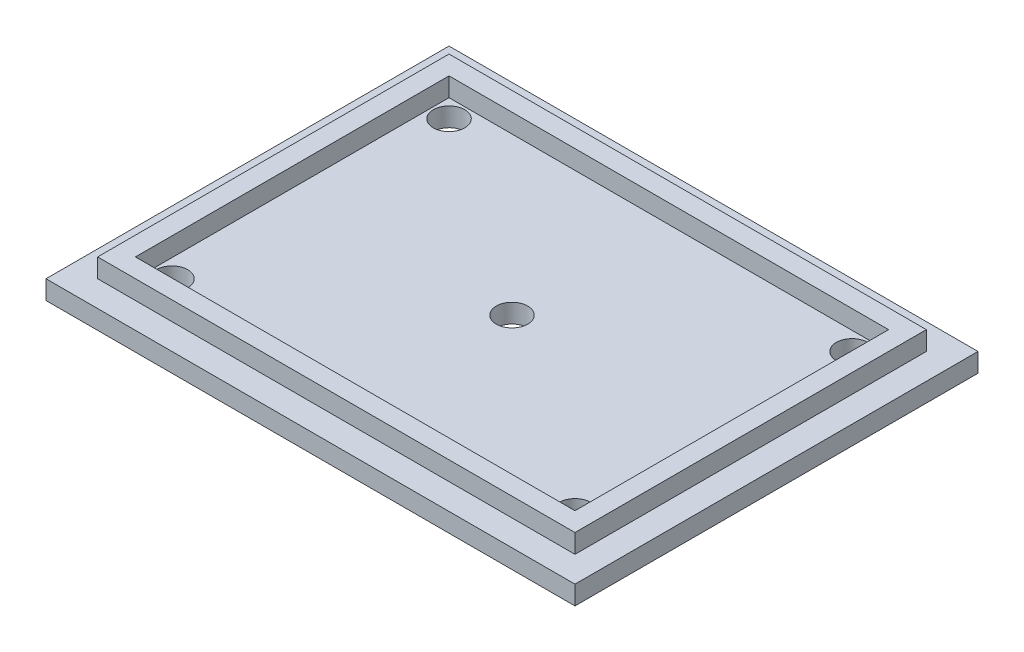
ISO-10303-21;
HEADER;
FILE_DESCRIPTION(('STEP AP214'),'2;1');
FILE_NAME('part.step','',(''),(''),'','','');
FILE_SCHEMA(('AUTOMOTIVE_DESIGN { 1 0 10303 214 1 1 1 1 }'));
ENDSEC;
DATA;
#1=APPLICATION_CONTEXT('core data for automotive mechanical design processes');
#2=APPLICATION_PROTOCOL_DEFINITION('international standard','automotive_design',2000,#1);
#3=PRODUCT_CONTEXT('',#1,'mechanical');
#4=PRODUCT('Part','Part','',(#3));
#5=PRODUCT_RELATED_PRODUCT_CATEGORY('part','',(#4));
#6=PRODUCT_DEFINITION_FORMATION('','',#4);
#7=PRODUCT_DEFINITION_CONTEXT('part definition',#1,'design');
#8=PRODUCT_DEFINITION('design','',#6,#7);
#9=PRODUCT_DEFINITION_SHAPE('','',#8);
#10=(LENGTH_UNIT() NAMED_UNIT(*) SI_UNIT(.MILLI.,.METRE.));
#11=(NAMED_UNIT(*) PLANE_ANGLE_UNIT() SI_UNIT($,.RADIAN.));
#12=(NAMED_UNIT(*) SI_UNIT($,.STERADIAN.) SOLID_ANGLE_UNIT());
#13=UNCERTAINTY_MEASURE_WITH_UNIT(LENGTH_MEASURE(1.E-05),#10,'distance_accuracy_value','');
#14=(GEOMETRIC_REPRESENTATION_CONTEXT(3) GLOBAL_UNCERTAINTY_ASSIGNED_CONTEXT((#13)) GLOBAL_UNIT_ASSIGNED_CONTEXT((#10,
#11,#12)) REPRESENTATION_CONTEXT('',''));
#15=CARTESIAN_POINT('',(0.,0.,0.));
#16=DIRECTION('',(0.,0.,1.));
#17=DIRECTION('',(1.,0.,0.));
#18=AXIS2_PLACEMENT_3D('',#15,#16,#17);
#19=CARTESIAN_POINT('',(0.,3.,0.));
#20=DIRECTION('',(0.,-1.,0.));
#21=DIRECTION('',(0.,0.,-1.));
#22=AXIS2_PLACEMENT_3D('',#19,#20,#21);
#23=PLANE('',#22);
#24=DIRECTION('',(0.,0.,1.));
#25=VECTOR('',#24,1.);
#26=CARTESIAN_POINT('',(0.,3.,0.));
#27=LINE('',#26,#25);
#28=CARTESIAN_POINT('',(0.,3.,-64.));
#29=VERTEX_POINT('',#28);
#30=CARTESIAN_POINT('',(0.,3.,0.));
#31=VERTEX_POINT('',#30);
#32=EDGE_CURVE('E229',#29,#31,#27,.T.);
#33=ORIENTED_EDGE('',*,*,#32,.T.);
#34=DIRECTION('',(1.,0.,0.));
#35=VECTOR('',#34,1.);
#36=CARTESIAN_POINT('',(0.,3.,0.));
#37=LINE('',#36,#35);
#38=CARTESIAN_POINT('',(84.,3.,0.));
#39=VERTEX_POINT('',#38);
#40=EDGE_CURVE('E233',#31,#39,#37,.T.);
#41=ORIENTED_EDGE('',*,*,#40,.T.);
#42=DIRECTION('',(0.,0.,-1.));
#43=VECTOR('',#42,1.);
#44=CARTESIAN_POINT('',(84.,3.,0.));
#45=LINE('',#44,#43);
#46=CARTESIAN_POINT('',(84.,3.,-64.));
#47=VERTEX_POINT('',#46);
#48=EDGE_CURVE('E237',#39,#47,#45,.T.);
#49=ORIENTED_EDGE('',*,*,#48,.T.);
#50=DIRECTION('',(-1.,0.,0.));
#51=VECTOR('',#50,1.);
#52=CARTESIAN_POINT('',(0.,3.,-64.));
#53=LINE('',#52,#51);
#54=EDGE_CURVE('E240',#47,#29,#53,.T.);
#55=ORIENTED_EDGE('',*,*,#54,.T.);
#56=EDGE_LOOP('',(#33,#41,#49,#55));
#57=FACE_BOUND('',#56,.T.);
#58=DIRECTION('',(0.,0.,1.));
#59=VECTOR('',#58,1.);
#60=CARTESIAN_POINT('',(4.1,3.,-59.9));
#61=LINE('',#60,#59);
#62=CARTESIAN_POINT('',(4.1,3.,-59.9));
#63=VERTEX_POINT('',#62);
#64=CARTESIAN_POINT('',(4.10000000000001,3.,-4.1));
#65=VERTEX_POINT('',#64);
#66=EDGE_CURVE('E154',#63,#65,#61,.T.);
#67=ORIENTED_EDGE('',*,*,#66,.F.);
#68=DIRECTION('',(-1.,0.,0.));
#69=VECTOR('',#68,1.);
#70=CARTESIAN_POINT('',(4.1,3.,-59.9));
#71=LINE('',#70,#69);
#72=CARTESIAN_POINT('',(79.9,3.,-59.9));
#73=VERTEX_POINT('',#72);
#74=EDGE_CURVE('E194',#73,#63,#71,.T.);
#75=ORIENTED_EDGE('',*,*,#74,.F.);
#76=DIRECTION('',(0.,0.,-1.));
#77=VECTOR('',#76,1.);
#78=CARTESIAN_POINT('',(79.9,3.,-59.9));
#79=LINE('',#78,#77);
#80=CARTESIAN_POINT('',(79.9,3.,-4.1));
#81=VERTEX_POINT('',#80);
#82=EDGE_CURVE('E66',#81,#73,#79,.T.);
#83=ORIENTED_EDGE('',*,*,#82,.F.);
#84=DIRECTION('',(1.,0.,0.));
#85=VECTOR('',#84,1.);
#86=CARTESIAN_POINT('',(4.10000000000001,3.,-4.1));
#87=LINE('',#86,#85);
#88=EDGE_CURVE('E61',#65,#81,#87,.T.);
#89=ORIENTED_EDGE('',*,*,#88,.F.);
#90=EDGE_LOOP('',(#67,#75,#83,#89));
#91=FACE_BOUND('',#90,.T.);
#92=ADVANCED_FACE('F43',(#57,#91),#23,.F.);
#93=CARTESIAN_POINT('',(0.,3.,0.));
#94=DIRECTION('',(1.,0.,0.));
#95=DIRECTION('',(0.,0.,-1.));
#96=AXIS2_PLACEMENT_3D('',#93,#94,#95);
#97=PLANE('',#96);
#98=DIRECTION('',(0.,0.,1.));
#99=VECTOR('',#98,1.);
#100=CARTESIAN_POINT('',(0.,0.,0.));
#101=LINE('',#100,#99);
#102=CARTESIAN_POINT('',(0.,0.,-64.));
#103=VERTEX_POINT('',#102);
#104=CARTESIAN_POINT('',(0.,0.,0.));
#105=VERTEX_POINT('',#104);
#106=EDGE_CURVE('E228',#103,#105,#101,.T.);
#107=ORIENTED_EDGE('',*,*,#106,.T.);
#108=DIRECTION('',(0.,-1.,0.));
#109=VECTOR('',#108,1.);
#110=CARTESIAN_POINT('',(0.,3.,0.));
#111=LINE('',#110,#109);
#112=EDGE_CURVE('E11',#31,#105,#111,.T.);
#113=ORIENTED_EDGE('',*,*,#112,.F.);
#114=ORIENTED_EDGE('',*,*,#32,.F.);
#115=DIRECTION('',(0.,-1.,0.));
#116=VECTOR('',#115,1.);
#117=CARTESIAN_POINT('',(0.,3.,-64.));
#118=LINE('',#117,#116);
#119=EDGE_CURVE('E243',#29,#103,#118,.T.);
#120=ORIENTED_EDGE('',*,*,#119,.T.);
#121=EDGE_LOOP('',(#107,#113,#114,#120));
#122=FACE_BOUND('',#121,.T.);
#123=ADVANCED_FACE('F45',(#122),#97,.F.);
#124=CARTESIAN_POINT('',(0.,3.,0.));
#125=DIRECTION('',(0.,0.,-1.));
#126=DIRECTION('',(-1.,0.,0.));
#127=AXIS2_PLACEMENT_3D('',#124,#125,#126);
#128=PLANE('',#127);
#129=DIRECTION('',(1.,0.,0.));
#130=VECTOR('',#129,1.);
#131=CARTESIAN_POINT('',(0.,0.,0.));
#132=LINE('',#131,#130);
#133=CARTESIAN_POINT('',(84.,0.,0.));
#134=VERTEX_POINT('',#133);
#135=EDGE_CURVE('E247',#105,#134,#132,.T.);
#136=ORIENTED_EDGE('',*,*,#135,.T.);
#137=DIRECTION('',(0.,-1.,0.));
#138=VECTOR('',#137,1.);
#139=CARTESIAN_POINT('',(84.,3.,0.));
#140=LINE('',#139,#138);
#141=EDGE_CURVE('E53',#39,#134,#140,.T.);
#142=ORIENTED_EDGE('',*,*,#141,.F.);
#143=ORIENTED_EDGE('',*,*,#40,.F.);
#144=ORIENTED_EDGE('',*,*,#112,.T.);
#145=EDGE_LOOP('',(#136,#142,#143,#144));
#146=FACE_BOUND('',#145,.T.);
#147=ADVANCED_FACE('F307',(#146),#128,.F.);
#148=CARTESIAN_POINT('',(84.,3.,0.));
#149=DIRECTION('',(-1.,0.,0.));
#150=DIRECTION('',(0.,0.,1.));
#151=AXIS2_PLACEMENT_3D('',#148,#149,#150);
#152=PLANE('',#151);
#153=DIRECTION('',(0.,0.,-1.));
#154=VECTOR('',#153,1.);
#155=CARTESIAN_POINT('',(84.,0.,0.));
#156=LINE('',#155,#154);
#157=CARTESIAN_POINT('',(84.,0.,-64.));
#158=VERTEX_POINT('',#157);
#159=EDGE_CURVE('E250',#134,#158,#156,.T.);
#160=ORIENTED_EDGE('',*,*,#159,.T.);
#161=DIRECTION('',(0.,-1.,0.));
#162=VECTOR('',#161,1.);
#163=CARTESIAN_POINT('',(84.,3.,-64.));
#164=LINE('',#163,#162);
#165=EDGE_CURVE('E258',#47,#158,#164,.T.);
#166=ORIENTED_EDGE('',*,*,#165,.F.);
#167=ORIENTED_EDGE('',*,*,#48,.F.);
#168=ORIENTED_EDGE('',*,*,#141,.T.);
#169=EDGE_LOOP('',(#160,#166,#167,#168));
#170=FACE_BOUND('',#169,.T.);
#171=ADVANCED_FACE('F499',(#170),#152,.F.);
#172=CARTESIAN_POINT('',(0.,3.,-64.));
#173=DIRECTION('',(0.,0.,1.));
#174=DIRECTION('',(1.,0.,0.));
#175=AXIS2_PLACEMENT_3D('',#172,#173,#174);
#176=PLANE('',#175);
#177=DIRECTION('',(-1.,0.,0.));
#178=VECTOR('',#177,1.);
#179=CARTESIAN_POINT('',(0.,0.,-64.));
#180=LINE('',#179,#178);
#181=EDGE_CURVE('E234',#158,#103,#180,.T.);
#182=ORIENTED_EDGE('',*,*,#181,.T.);
#183=ORIENTED_EDGE('',*,*,#119,.F.);
#184=ORIENTED_EDGE('',*,*,#54,.F.);
#185=ORIENTED_EDGE('',*,*,#165,.T.);
#186=EDGE_LOOP('',(#182,#183,#184,#185));
#187=FACE_BOUND('',#186,.T.);
#188=ADVANCED_FACE('F402',(#187),#176,.F.);
#189=CARTESIAN_POINT('',(0.,0.,0.));
#190=DIRECTION('',(0.,-1.,0.));
#191=DIRECTION('',(0.,0.,-1.));
#192=AXIS2_PLACEMENT_3D('',#189,#190,#191);
#193=PLANE('',#192);
#194=CARTESIAN_POINT('',(10.,0.,-54.));
#195=DIRECTION('',(0.,-1.,0.));
#196=DIRECTION('',(0.,0.,-1.));
#197=AXIS2_PLACEMENT_3D('',#194,#195,#196);
#198=CIRCLE('',#197,2.5);
#199=CARTESIAN_POINT('',(10.,0.,-56.5));
#200=VERTEX_POINT('',#199);
#201=EDGE_CURVE('E572',#200,#200,#198,.T.);
#202=ORIENTED_EDGE('',*,*,#201,.F.);
#203=EDGE_LOOP('',(#202));
#204=FACE_BOUND('',#203,.T.);
#205=CARTESIAN_POINT('',(74.,0.,-54.));
#206=DIRECTION('',(0.,-1.,0.));
#207=DIRECTION('',(0.,0.,-1.));
#208=AXIS2_PLACEMENT_3D('',#205,#206,#207);
#209=CIRCLE('',#208,2.50000000000001);
#210=CARTESIAN_POINT('',(74.,0.,-56.5));
#211=VERTEX_POINT('',#210);
#212=EDGE_CURVE('E565',#211,#211,#209,.T.);
#213=ORIENTED_EDGE('',*,*,#212,.F.);
#214=EDGE_LOOP('',(#213));
#215=FACE_BOUND('',#214,.T.);
#216=CARTESIAN_POINT('',(74.,0.,-10.));
#217=DIRECTION('',(0.,-1.,0.));
#218=DIRECTION('',(0.,0.,-1.));
#219=AXIS2_PLACEMENT_3D('',#216,#217,#218);
#220=CIRCLE('',#219,2.50000000000001);
#221=CARTESIAN_POINT('',(74.,0.,-12.5));
#222=VERTEX_POINT('',#221);
#223=EDGE_CURVE('E551',#222,#222,#220,.T.);
#224=ORIENTED_EDGE('',*,*,#223,.F.);
#225=EDGE_LOOP('',(#224));
#226=FACE_BOUND('',#225,.T.);
#227=CARTESIAN_POINT('',(10.,0.,-10.));
#228=DIRECTION('',(0.,-1.,0.));
#229=DIRECTION('',(0.,0.,-1.));
#230=AXIS2_PLACEMENT_3D('',#227,#228,#229);
#231=CIRCLE('',#230,2.5);
#232=CARTESIAN_POINT('',(10.,0.,-12.5));
#233=VERTEX_POINT('',#232);
#234=EDGE_CURVE('E564',#233,#233,#231,.T.);
#235=ORIENTED_EDGE('',*,*,#234,.F.);
#236=EDGE_LOOP('',(#235));
#237=FACE_BOUND('',#236,.T.);
#238=CARTESIAN_POINT('',(42.,0.,-32.));
#239=DIRECTION('',(0.,-1.,0.));
#240=DIRECTION('',(0.,0.,-1.));
#241=AXIS2_PLACEMENT_3D('',#238,#239,#240);
#242=CIRCLE('',#241,2.5);
#243=CARTESIAN_POINT('',(42.,0.,-34.5));
#244=VERTEX_POINT('',#243);
#245=EDGE_CURVE('E270',#244,#244,#242,.T.);
#246=ORIENTED_EDGE('',*,*,#245,.F.);
#247=EDGE_LOOP('',(#246));
#248=FACE_BOUND('',#247,.T.);
#249=ORIENTED_EDGE('',*,*,#106,.F.);
#250=ORIENTED_EDGE('',*,*,#181,.F.);
#251=ORIENTED_EDGE('',*,*,#159,.F.);
#252=ORIENTED_EDGE('',*,*,#135,.F.);
#253=EDGE_LOOP('',(#249,#250,#251,#252));
#254=FACE_BOUND('',#253,.T.);
#255=ADVANCED_FACE('F338',(#204,#215,#226,#237,#248,#254),#193,.T.);
#256=CARTESIAN_POINT('',(0.,6.,0.));
#257=DIRECTION('',(0.,1.,0.));
#258=DIRECTION('',(0.,0.,1.));
#259=AXIS2_PLACEMENT_3D('',#256,#257,#258);
#260=PLANE('',#259);
#261=DIRECTION('',(0.,0.,1.));
#262=VECTOR('',#261,1.);
#263=CARTESIAN_POINT('',(4.1,6.,-59.9));
#264=LINE('',#263,#262);
#265=CARTESIAN_POINT('',(4.1,6.,-59.9));
#266=VERTEX_POINT('',#265);
#267=CARTESIAN_POINT('',(4.10000000000001,6.,-4.1));
#268=VERTEX_POINT('',#267);
#269=EDGE_CURVE('E189',#266,#268,#264,.T.);
#270=ORIENTED_EDGE('',*,*,#269,.T.);
#271=DIRECTION('',(1.,0.,0.));
#272=VECTOR('',#271,1.);
#273=CARTESIAN_POINT('',(4.10000000000001,6.,-4.1));
#274=LINE('',#273,#272);
#275=CARTESIAN_POINT('',(79.9,6.,-4.1));
#276=VERTEX_POINT('',#275);
#277=EDGE_CURVE('E193',#268,#276,#274,.T.);
#278=ORIENTED_EDGE('',*,*,#277,.T.);
#279=DIRECTION('',(0.,0.,-1.));
#280=VECTOR('',#279,1.);
#281=CARTESIAN_POINT('',(79.9,6.,-59.9));
#282=LINE('',#281,#280);
#283=CARTESIAN_POINT('',(79.9,6.,-59.9));
#284=VERTEX_POINT('',#283);
#285=EDGE_CURVE('E197',#276,#284,#282,.T.);
#286=ORIENTED_EDGE('',*,*,#285,.T.);
#287=DIRECTION('',(-1.,0.,0.));
#288=VECTOR('',#287,1.);
#289=CARTESIAN_POINT('',(4.1,6.,-59.9));
#290=LINE('',#289,#288);
#291=EDGE_CURVE('E200',#284,#266,#290,.T.);
#292=ORIENTED_EDGE('',*,*,#291,.T.);
#293=EDGE_LOOP('',(#270,#278,#286,#292));
#294=FACE_BOUND('',#293,.T.);
#295=DIRECTION('',(0.,0.,1.));
#296=VECTOR('',#295,1.);
#297=CARTESIAN_POINT('',(7.1,6.,-56.9));
#298=LINE('',#297,#296);
#299=CARTESIAN_POINT('',(7.1,6.,-56.9));
#300=VERTEX_POINT('',#299);
#301=CARTESIAN_POINT('',(7.10000000000001,6.,-7.1));
#302=VERTEX_POINT('',#301);
#303=EDGE_CURVE('E145',#300,#302,#298,.T.);
#304=ORIENTED_EDGE('',*,*,#303,.F.);
#305=DIRECTION('',(-1.,0.,0.));
#306=VECTOR('',#305,1.);
#307=CARTESIAN_POINT('',(7.1,6.,-56.9));
#308=LINE('',#307,#306);
#309=CARTESIAN_POINT('',(76.9,6.,-56.9));
#310=VERTEX_POINT('',#309);
#311=EDGE_CURVE('E134',#310,#300,#308,.T.);
#312=ORIENTED_EDGE('',*,*,#311,.F.);
#313=DIRECTION('',(0.,0.,-1.));
#314=VECTOR('',#313,1.);
#315=CARTESIAN_POINT('',(76.9,6.,-56.9));
#316=LINE('',#315,#314);
#317=CARTESIAN_POINT('',(76.9,6.,-7.1));
#318=VERTEX_POINT('',#317);
#319=EDGE_CURVE('E164',#318,#310,#316,.T.);
#320=ORIENTED_EDGE('',*,*,#319,.F.);
#321=DIRECTION('',(1.,0.,0.));
#322=VECTOR('',#321,1.);
#323=CARTESIAN_POINT('',(7.10000000000001,6.,-7.1));
#324=LINE('',#323,#322);
#325=EDGE_CURVE('E160',#302,#318,#324,.T.);
#326=ORIENTED_EDGE('',*,*,#325,.F.);
#327=EDGE_LOOP('',(#304,#312,#320,#326));
#328=FACE_BOUND('',#327,.T.);
#329=ADVANCED_FACE('F158',(#294,#328),#260,.T.);
#330=CARTESIAN_POINT('',(4.1,6.,-59.9));
#331=DIRECTION('',(1.,0.,0.));
#332=DIRECTION('',(0.,0.,-1.));
#333=AXIS2_PLACEMENT_3D('',#330,#331,#332);
#334=PLANE('',#333);
#335=ORIENTED_EDGE('',*,*,#66,.T.);
#336=DIRECTION('',(0.,-1.,0.));
#337=VECTOR('',#336,1.);
#338=CARTESIAN_POINT('',(4.10000000000001,6.,-4.1));
#339=LINE('',#338,#337);
#340=EDGE_CURVE('E225',#268,#65,#339,.T.);
#341=ORIENTED_EDGE('',*,*,#340,.F.);
#342=ORIENTED_EDGE('',*,*,#269,.F.);
#343=DIRECTION('',(0.,-1.,0.));
#344=VECTOR('',#343,1.);
#345=CARTESIAN_POINT('',(4.1,6.,-59.9));
#346=LINE('',#345,#344);
#347=EDGE_CURVE('E203',#266,#63,#346,.T.);
#348=ORIENTED_EDGE('',*,*,#347,.T.);
#349=EDGE_LOOP('',(#335,#341,#342,#348));
#350=FACE_BOUND('',#349,.T.);
#351=ADVANCED_FACE('F337',(#350),#334,.F.);
#352=CARTESIAN_POINT('',(4.10000000000001,6.,-4.1));
#353=DIRECTION('',(0.,0.,-1.));
#354=DIRECTION('',(-1.,0.,0.));
#355=AXIS2_PLACEMENT_3D('',#352,#353,#354);
#356=PLANE('',#355);
#357=ORIENTED_EDGE('',*,*,#88,.T.);
#358=DIRECTION('',(0.,-1.,0.));
#359=VECTOR('',#358,1.);
#360=CARTESIAN_POINT('',(79.9,6.,-4.1));
#361=LINE('',#360,#359);
#362=EDGE_CURVE('E221',#276,#81,#361,.T.);
#363=ORIENTED_EDGE('',*,*,#362,.F.);
#364=ORIENTED_EDGE('',*,*,#277,.F.);
#365=ORIENTED_EDGE('',*,*,#340,.T.);
#366=EDGE_LOOP('',(#357,#363,#364,#365));
#367=FACE_BOUND('',#366,.T.);
#368=ADVANCED_FACE('F346',(#367),#356,.F.);
#369=CARTESIAN_POINT('',(79.9,6.,-59.9));
#370=DIRECTION('',(-1.,0.,0.));
#371=DIRECTION('',(0.,0.,1.));
#372=AXIS2_PLACEMENT_3D('',#369,#370,#371);
#373=PLANE('',#372);
#374=ORIENTED_EDGE('',*,*,#82,.T.);
#375=DIRECTION('',(0.,-1.,0.));
#376=VECTOR('',#375,1.);
#377=CARTESIAN_POINT('',(79.9,6.,-59.9));
#378=LINE('',#377,#376);
#379=EDGE_CURVE('E217',#284,#73,#378,.T.);
#380=ORIENTED_EDGE('',*,*,#379,.F.);
#381=ORIENTED_EDGE('',*,*,#285,.F.);
#382=ORIENTED_EDGE('',*,*,#362,.T.);
#383=EDGE_LOOP('',(#374,#380,#381,#382));
#384=FACE_BOUND('',#383,.T.);
#385=ADVANCED_FACE('F342',(#384),#373,.F.);
#386=CARTESIAN_POINT('',(4.1,6.,-59.9));
#387=DIRECTION('',(0.,0.,1.));
#388=DIRECTION('',(1.,0.,0.));
#389=AXIS2_PLACEMENT_3D('',#386,#387,#388);
#390=PLANE('',#389);
#391=ORIENTED_EDGE('',*,*,#74,.T.);
#392=ORIENTED_EDGE('',*,*,#347,.F.);
#393=ORIENTED_EDGE('',*,*,#291,.F.);
#394=ORIENTED_EDGE('',*,*,#379,.T.);
#395=EDGE_LOOP('',(#391,#392,#393,#394));
#396=FACE_BOUND('',#395,.T.);
#397=ADVANCED_FACE('F334',(#396),#390,.F.);
#398=CARTESIAN_POINT('',(7.1,6.,-56.9));
#399=DIRECTION('',(0.,0.,1.));
#400=DIRECTION('',(1.,0.,0.));
#401=AXIS2_PLACEMENT_3D('',#398,#399,#400);
#402=PLANE('',#401);
#403=DIRECTION('',(-1.,0.,0.));
#404=VECTOR('',#403,1.);
#405=CARTESIAN_POINT('',(7.1,3.,-56.9));
#406=LINE('',#405,#404);
#407=CARTESIAN_POINT('',(76.9,3.,-56.9));
#408=VERTEX_POINT('',#407);
#409=CARTESIAN_POINT('',(7.1,3.,-56.9));
#410=VERTEX_POINT('',#409);
#411=EDGE_CURVE('E170',#408,#410,#406,.T.);
#412=ORIENTED_EDGE('',*,*,#411,.F.);
#413=DIRECTION('',(0.,-1.,0.));
#414=VECTOR('',#413,1.);
#415=CARTESIAN_POINT('',(76.9,6.,-56.9));
#416=LINE('',#415,#414);
#417=EDGE_CURVE('E140',#310,#408,#416,.T.);
#418=ORIENTED_EDGE('',*,*,#417,.F.);
#419=ORIENTED_EDGE('',*,*,#311,.T.);
#420=DIRECTION('',(0.,-1.,0.));
#421=VECTOR('',#420,1.);
#422=CARTESIAN_POINT('',(7.1,6.,-56.9));
#423=LINE('',#422,#421);
#424=EDGE_CURVE('E138',#300,#410,#423,.T.);
#425=ORIENTED_EDGE('',*,*,#424,.T.);
#426=EDGE_LOOP('',(#412,#418,#419,#425));
#427=FACE_BOUND('',#426,.T.);
#428=ADVANCED_FACE('F137',(#427),#402,.T.);
#429=CARTESIAN_POINT('',(7.1,6.,-56.9));
#430=DIRECTION('',(1.,0.,0.));
#431=DIRECTION('',(0.,0.,-1.));
#432=AXIS2_PLACEMENT_3D('',#429,#430,#431);
#433=PLANE('',#432);
#434=DIRECTION('',(0.,0.,1.));
#435=VECTOR('',#434,1.);
#436=CARTESIAN_POINT('',(7.1,3.,-56.9));
#437=LINE('',#436,#435);
#438=CARTESIAN_POINT('',(7.10000000000001,3.,-7.1));
#439=VERTEX_POINT('',#438);
#440=EDGE_CURVE('E152',#410,#439,#437,.T.);
#441=ORIENTED_EDGE('',*,*,#440,.F.);
#442=ORIENTED_EDGE('',*,*,#424,.F.);
#443=ORIENTED_EDGE('',*,*,#303,.T.);
#444=DIRECTION('',(0.,-1.,0.));
#445=VECTOR('',#444,1.);
#446=CARTESIAN_POINT('',(7.10000000000001,6.,-7.1));
#447=LINE('',#446,#445);
#448=EDGE_CURVE('E155',#302,#439,#447,.T.);
#449=ORIENTED_EDGE('',*,*,#448,.T.);
#450=EDGE_LOOP('',(#441,#442,#443,#449));
#451=FACE_BOUND('',#450,.T.);
#452=ADVANCED_FACE('F149',(#451),#433,.T.);
#453=CARTESIAN_POINT('',(7.10000000000001,6.,-7.1));
#454=DIRECTION('',(0.,0.,-1.));
#455=DIRECTION('',(-1.,0.,0.));
#456=AXIS2_PLACEMENT_3D('',#453,#454,#455);
#457=PLANE('',#456);
#458=DIRECTION('',(1.,0.,0.));
#459=VECTOR('',#458,1.);
#460=CARTESIAN_POINT('',(7.10000000000001,3.,-7.1));
#461=LINE('',#460,#459);
#462=CARTESIAN_POINT('',(76.9,3.,-7.1));
#463=VERTEX_POINT('',#462);
#464=EDGE_CURVE('E175',#439,#463,#461,.T.);
#465=ORIENTED_EDGE('',*,*,#464,.F.);
#466=ORIENTED_EDGE('',*,*,#448,.F.);
#467=ORIENTED_EDGE('',*,*,#325,.T.);
#468=DIRECTION('',(0.,-1.,0.));
#469=VECTOR('',#468,1.);
#470=CARTESIAN_POINT('',(76.9,6.,-7.1));
#471=LINE('',#470,#469);
#472=EDGE_CURVE('E184',#318,#463,#471,.T.);
#473=ORIENTED_EDGE('',*,*,#472,.T.);
#474=EDGE_LOOP('',(#465,#466,#467,#473));
#475=FACE_BOUND('',#474,.T.);
#476=ADVANCED_FACE('F320',(#475),#457,.T.);
#477=CARTESIAN_POINT('',(76.9,6.,-56.9));
#478=DIRECTION('',(-1.,0.,0.));
#479=DIRECTION('',(0.,0.,1.));
#480=AXIS2_PLACEMENT_3D('',#477,#478,#479);
#481=PLANE('',#480);
#482=DIRECTION('',(0.,0.,-1.));
#483=VECTOR('',#482,1.);
#484=CARTESIAN_POINT('',(76.9,3.,-56.9));
#485=LINE('',#484,#483);
#486=EDGE_CURVE('E146',#463,#408,#485,.T.);
#487=ORIENTED_EDGE('',*,*,#486,.F.);
#488=ORIENTED_EDGE('',*,*,#472,.F.);
#489=ORIENTED_EDGE('',*,*,#319,.T.);
#490=ORIENTED_EDGE('',*,*,#417,.T.);
#491=EDGE_LOOP('',(#487,#488,#489,#490));
#492=FACE_BOUND('',#491,.T.);
#493=ADVANCED_FACE('F313',(#492),#481,.T.);
#494=CARTESIAN_POINT('',(10.,3.,-54.));
#495=DIRECTION('',(0.,-1.,0.));
#496=DIRECTION('',(0.,0.,-1.));
#497=AXIS2_PLACEMENT_3D('',#494,#495,#496);
#498=CIRCLE('',#497,2.5);
#499=CARTESIAN_POINT('',(10.,3.,-56.5));
#500=VERTEX_POINT('',#499);
#501=EDGE_CURVE('E47',#500,#500,#498,.T.);
#502=ORIENTED_EDGE('',*,*,#501,.T.);
#503=EDGE_LOOP('',(#502));
#504=FACE_BOUND('',#503,.T.);
#505=CARTESIAN_POINT('',(74.,3.,-54.));
#506=DIRECTION('',(0.,-1.,0.));
#507=DIRECTION('',(0.,0.,-1.));
#508=AXIS2_PLACEMENT_3D('',#505,#506,#507);
#509=CIRCLE('',#508,2.50000000000001);
#510=CARTESIAN_POINT('',(74.,3.,-56.5));
#511=VERTEX_POINT('',#510);
#512=EDGE_CURVE('E277',#511,#511,#509,.T.);
#513=ORIENTED_EDGE('',*,*,#512,.T.);
#514=EDGE_LOOP('',(#513));
#515=FACE_BOUND('',#514,.T.);
#516=CARTESIAN_POINT('',(74.,3.,-10.));
#517=DIRECTION('',(0.,-1.,0.));
#518=DIRECTION('',(0.,0.,-1.));
#519=AXIS2_PLACEMENT_3D('',#516,#517,#518);
#520=CIRCLE('',#519,2.50000000000001);
#521=CARTESIAN_POINT('',(74.,3.,-12.5));
#522=VERTEX_POINT('',#521);
#523=EDGE_CURVE('E274',#522,#522,#520,.T.);
#524=ORIENTED_EDGE('',*,*,#523,.T.);
#525=EDGE_LOOP('',(#524));
#526=FACE_BOUND('',#525,.T.);
#527=CARTESIAN_POINT('',(10.,3.,-10.));
#528=DIRECTION('',(0.,-1.,0.));
#529=DIRECTION('',(0.,0.,-1.));
#530=AXIS2_PLACEMENT_3D('',#527,#528,#529);
#531=CIRCLE('',#530,2.5);
#532=CARTESIAN_POINT('',(10.,3.,-12.5));
#533=VERTEX_POINT('',#532);
#534=EDGE_CURVE('E269',#533,#533,#531,.T.);
#535=ORIENTED_EDGE('',*,*,#534,.T.);
#536=EDGE_LOOP('',(#535));
#537=FACE_BOUND('',#536,.T.);
#538=CARTESIAN_POINT('',(42.,3.,-32.));
#539=DIRECTION('',(0.,-1.,0.));
#540=DIRECTION('',(0.,0.,-1.));
#541=AXIS2_PLACEMENT_3D('',#538,#539,#540);
#542=CIRCLE('',#541,2.5);
#543=CARTESIAN_POINT('',(42.,3.,-34.5));
#544=VERTEX_POINT('',#543);
#545=EDGE_CURVE('E265',#544,#544,#542,.T.);
#546=ORIENTED_EDGE('',*,*,#545,.T.);
#547=EDGE_LOOP('',(#546));
#548=FACE_BOUND('',#547,.T.);
#549=ORIENTED_EDGE('',*,*,#486,.T.);
#550=ORIENTED_EDGE('',*,*,#411,.T.);
#551=ORIENTED_EDGE('',*,*,#440,.T.);
#552=ORIENTED_EDGE('',*,*,#464,.T.);
#553=EDGE_LOOP('',(#549,#550,#551,#552));
#554=FACE_BOUND('',#553,.T.);
#555=ADVANCED_FACE('F286',(#504,#515,#526,#537,#548,#554),#23,.F.);
#556=CARTESIAN_POINT('',(42.,6.,-32.));
#557=DIRECTION('',(0.,-1.,0.));
#558=DIRECTION('',(0.,0.,-1.));
#559=AXIS2_PLACEMENT_3D('',#556,#557,#558);
#560=CYLINDRICAL_SURFACE('',#559,2.5);
#561=ORIENTED_EDGE('',*,*,#245,.T.);
#562=EDGE_LOOP('',(#561));
#563=FACE_BOUND('',#562,.T.);
#564=ORIENTED_EDGE('',*,*,#545,.F.);
#565=EDGE_LOOP('',(#564));
#566=FACE_BOUND('',#565,.T.);
#567=ADVANCED_FACE('F312',(#563,#566),#560,.F.);
#568=CARTESIAN_POINT('',(10.,6.,-10.));
#569=DIRECTION('',(0.,-1.,0.));
#570=DIRECTION('',(0.,0.,-1.));
#571=AXIS2_PLACEMENT_3D('',#568,#569,#570);
#572=CYLINDRICAL_SURFACE('',#571,2.5);
#573=ORIENTED_EDGE('',*,*,#234,.T.);
#574=EDGE_LOOP('',(#573));
#575=FACE_BOUND('',#574,.T.);
#576=ORIENTED_EDGE('',*,*,#534,.F.);
#577=EDGE_LOOP('',(#576));
#578=FACE_BOUND('',#577,.T.);
#579=ADVANCED_FACE('F318',(#575,#578),#572,.F.);
#580=CARTESIAN_POINT('',(74.,6.,-10.));
#581=DIRECTION('',(0.,-1.,0.));
#582=DIRECTION('',(0.,0.,-1.));
#583=AXIS2_PLACEMENT_3D('',#580,#581,#582);
#584=CYLINDRICAL_SURFACE('',#583,2.50000000000001);
#585=ORIENTED_EDGE('',*,*,#223,.T.);
#586=EDGE_LOOP('',(#585));
#587=FACE_BOUND('',#586,.T.);
#588=ORIENTED_EDGE('',*,*,#523,.F.);
#589=EDGE_LOOP('',(#588));
#590=FACE_BOUND('',#589,.T.);
#591=ADVANCED_FACE('F296',(#587,#590),#584,.F.);
#592=CARTESIAN_POINT('',(74.,6.,-54.));
#593=DIRECTION('',(0.,-1.,0.));
#594=DIRECTION('',(0.,0.,-1.));
#595=AXIS2_PLACEMENT_3D('',#592,#593,#594);
#596=CYLINDRICAL_SURFACE('',#595,2.50000000000001);
#597=ORIENTED_EDGE('',*,*,#212,.T.);
#598=EDGE_LOOP('',(#597));
#599=FACE_BOUND('',#598,.T.);
#600=ORIENTED_EDGE('',*,*,#512,.F.);
#601=EDGE_LOOP('',(#600));
#602=FACE_BOUND('',#601,.T.);
#603=ADVANCED_FACE('F290',(#599,#602),#596,.F.);
#604=CARTESIAN_POINT('',(10.,6.,-54.));
#605=DIRECTION('',(0.,-1.,0.));
#606=DIRECTION('',(0.,0.,-1.));
#607=AXIS2_PLACEMENT_3D('',#604,#605,#606);
#608=CYLINDRICAL_SURFACE('',#607,2.5);
#609=ORIENTED_EDGE('',*,*,#201,.T.);
#610=EDGE_LOOP('',(#609));
#611=FACE_BOUND('',#610,.T.);
#612=ORIENTED_EDGE('',*,*,#501,.F.);
#613=EDGE_LOOP('',(#612));
#614=FACE_BOUND('',#613,.T.);
#615=ADVANCED_FACE('F288',(#611,#614),#608,.F.);
#616=CLOSED_SHELL('',(#92,#123,#147,#171,#188,#255,#329,#351,#368,#385,#397,#428,#452,#476,#493,
#555,#567,#579,#591,#603,#615));
#617=MANIFOLD_SOLID_BREP('B2',#616);
#618=ADVANCED_BREP_SHAPE_REPRESENTATION('',(#18,#617),#14);
#619=SHAPE_DEFINITION_REPRESENTATION(#9,#618);
ENDSEC;
END-ISO-10303-21;
